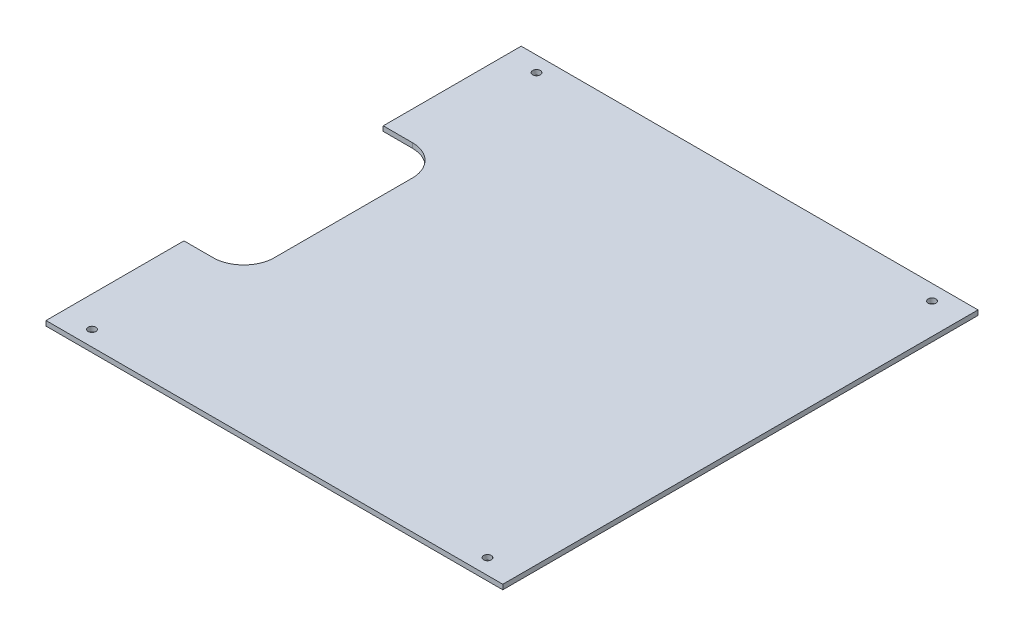
ISO-10303-21;
HEADER;
FILE_DESCRIPTION(('STEP AP214'),'2;1');
FILE_NAME('part.step','',(''),(''),'','','');
FILE_SCHEMA(('AUTOMOTIVE_DESIGN { 1 0 10303 214 1 1 1 1 }'));
ENDSEC;
DATA;
#1=APPLICATION_CONTEXT('core data for automotive mechanical design processes');
#2=APPLICATION_PROTOCOL_DEFINITION('international standard','automotive_design',2000,#1);
#3=PRODUCT_CONTEXT('',#1,'mechanical');
#4=PRODUCT('Part','Part','',(#3));
#5=PRODUCT_RELATED_PRODUCT_CATEGORY('part','',(#4));
#6=PRODUCT_DEFINITION_FORMATION('','',#4);
#7=PRODUCT_DEFINITION_CONTEXT('part definition',#1,'design');
#8=PRODUCT_DEFINITION('design','',#6,#7);
#9=PRODUCT_DEFINITION_SHAPE('','',#8);
#10=(LENGTH_UNIT() NAMED_UNIT(*) SI_UNIT(.MILLI.,.METRE.));
#11=(NAMED_UNIT(*) PLANE_ANGLE_UNIT() SI_UNIT($,.RADIAN.));
#12=(NAMED_UNIT(*) SI_UNIT($,.STERADIAN.) SOLID_ANGLE_UNIT());
#13=UNCERTAINTY_MEASURE_WITH_UNIT(LENGTH_MEASURE(1.E-05),#10,'distance_accuracy_value','');
#14=(GEOMETRIC_REPRESENTATION_CONTEXT(3) GLOBAL_UNCERTAINTY_ASSIGNED_CONTEXT((#13)) GLOBAL_UNIT_ASSIGNED_CONTEXT((#10,
#11,#12)) REPRESENTATION_CONTEXT('',''));
#15=CARTESIAN_POINT('',(0.,0.,0.));
#16=DIRECTION('',(0.,0.,1.));
#17=DIRECTION('',(1.,0.,0.));
#18=AXIS2_PLACEMENT_3D('',#15,#16,#17);
#19=CARTESIAN_POINT('',(0.,3.175,-220.));
#20=DIRECTION('',(0.,0.,-1.));
#21=DIRECTION('',(-1.,0.,0.));
#22=AXIS2_PLACEMENT_3D('',#19,#20,#21);
#23=PLANE('',#22);
#24=DIRECTION('',(1.,0.,0.));
#25=VECTOR('',#24,1.);
#26=CARTESIAN_POINT('',(0.,0.,-220.));
#27=LINE('',#26,#25);
#28=CARTESIAN_POINT('',(21.,0.,-220.));
#29=VERTEX_POINT('',#28);
#30=CARTESIAN_POINT('',(40.,0.,-220.));
#31=VERTEX_POINT('',#30);
#32=EDGE_CURVE('E147',#29,#31,#27,.T.);
#33=ORIENTED_EDGE('',*,*,#32,.T.);
#34=DIRECTION('',(0.,-1.,0.));
#35=VECTOR('',#34,1.);
#36=CARTESIAN_POINT('',(40.,3.175,-220.));
#37=LINE('',#36,#35);
#38=CARTESIAN_POINT('',(40.,3.175,-220.));
#39=VERTEX_POINT('',#38);
#40=EDGE_CURVE('E11',#39,#31,#37,.T.);
#41=ORIENTED_EDGE('',*,*,#40,.F.);
#42=DIRECTION('',(1.,0.,0.));
#43=VECTOR('',#42,1.);
#44=CARTESIAN_POINT('',(0.,3.175,-220.));
#45=LINE('',#44,#43);
#46=CARTESIAN_POINT('',(21.,3.175,-220.));
#47=VERTEX_POINT('',#46);
#48=EDGE_CURVE('E168',#47,#39,#45,.T.);
#49=ORIENTED_EDGE('',*,*,#48,.F.);
#50=DIRECTION('',(0.,-1.,0.));
#51=VECTOR('',#50,1.);
#52=CARTESIAN_POINT('',(21.,3.175,-220.));
#53=LINE('',#52,#51);
#54=EDGE_CURVE('E55',#47,#29,#53,.T.);
#55=ORIENTED_EDGE('',*,*,#54,.T.);
#56=EDGE_LOOP('',(#33,#41,#49,#55));
#57=FACE_BOUND('',#56,.T.);
#58=ADVANCED_FACE('F37',(#57),#23,.F.);
#59=CARTESIAN_POINT('',(40.,3.175,-200.));
#60=DIRECTION('',(0.,-1.,0.));
#61=DIRECTION('',(0.,0.,-1.));
#62=AXIS2_PLACEMENT_3D('',#59,#60,#61);
#63=CYLINDRICAL_SURFACE('',#62,20.);
#64=CARTESIAN_POINT('',(40.,0.,-200.));
#65=DIRECTION('',(0.,1.,0.));
#66=DIRECTION('',(0.,0.,1.));
#67=AXIS2_PLACEMENT_3D('',#64,#65,#66);
#68=CIRCLE('',#67,20.);
#69=CARTESIAN_POINT('',(60.,0.,-200.));
#70=VERTEX_POINT('',#69);
#71=EDGE_CURVE('E149',#31,#70,#68,.F.);
#72=ORIENTED_EDGE('',*,*,#71,.T.);
#73=DIRECTION('',(0.,-1.,0.));
#74=VECTOR('',#73,1.);
#75=CARTESIAN_POINT('',(60.,3.175,-200.));
#76=LINE('',#75,#74);
#77=CARTESIAN_POINT('',(60.,3.175,-200.));
#78=VERTEX_POINT('',#77);
#79=EDGE_CURVE('E46',#78,#70,#76,.T.);
#80=ORIENTED_EDGE('',*,*,#79,.F.);
#81=CARTESIAN_POINT('',(40.,3.175,-200.));
#82=DIRECTION('',(0.,1.,0.));
#83=DIRECTION('',(0.,0.,1.));
#84=AXIS2_PLACEMENT_3D('',#81,#82,#83);
#85=CIRCLE('',#84,20.);
#86=EDGE_CURVE('E99',#39,#78,#85,.F.);
#87=ORIENTED_EDGE('',*,*,#86,.F.);
#88=ORIENTED_EDGE('',*,*,#40,.T.);
#89=EDGE_LOOP('',(#72,#80,#87,#88));
#90=FACE_BOUND('',#89,.T.);
#91=ADVANCED_FACE('F216',(#90),#63,.F.);
#92=CARTESIAN_POINT('',(60.0000000000001,3.175,0.));
#93=DIRECTION('',(1.,0.,0.));
#94=DIRECTION('',(0.,0.,-1.));
#95=AXIS2_PLACEMENT_3D('',#92,#93,#94);
#96=PLANE('',#95);
#97=DIRECTION('',(0.,0.,1.));
#98=VECTOR('',#97,1.);
#99=CARTESIAN_POINT('',(60.0000000000001,0.,0.));
#100=LINE('',#99,#98);
#101=CARTESIAN_POINT('',(60.,0.,-110.));
#102=VERTEX_POINT('',#101);
#103=EDGE_CURVE('E151',#70,#102,#100,.T.);
#104=ORIENTED_EDGE('',*,*,#103,.T.);
#105=DIRECTION('',(0.,-1.,0.));
#106=VECTOR('',#105,1.);
#107=CARTESIAN_POINT('',(60.,3.175,-110.));
#108=LINE('',#107,#106);
#109=CARTESIAN_POINT('',(60.,3.175,-110.));
#110=VERTEX_POINT('',#109);
#111=EDGE_CURVE('E181',#110,#102,#108,.T.);
#112=ORIENTED_EDGE('',*,*,#111,.F.);
#113=DIRECTION('',(0.,0.,1.));
#114=VECTOR('',#113,1.);
#115=CARTESIAN_POINT('',(60.0000000000001,3.175,0.));
#116=LINE('',#115,#114);
#117=EDGE_CURVE('E277',#78,#110,#116,.T.);
#118=ORIENTED_EDGE('',*,*,#117,.F.);
#119=ORIENTED_EDGE('',*,*,#79,.T.);
#120=EDGE_LOOP('',(#104,#112,#118,#119));
#121=FACE_BOUND('',#120,.T.);
#122=ADVANCED_FACE('F220',(#121),#96,.F.);
#123=CARTESIAN_POINT('',(40.,3.175,-110.));
#124=DIRECTION('',(0.,-1.,0.));
#125=DIRECTION('',(0.,0.,-1.));
#126=AXIS2_PLACEMENT_3D('',#123,#124,#125);
#127=CYLINDRICAL_SURFACE('',#126,20.);
#128=CARTESIAN_POINT('',(40.,0.,-110.));
#129=DIRECTION('',(0.,1.,0.));
#130=DIRECTION('',(0.,0.,1.));
#131=AXIS2_PLACEMENT_3D('',#128,#129,#130);
#132=CIRCLE('',#131,20.);
#133=CARTESIAN_POINT('',(40.,0.,-90.));
#134=VERTEX_POINT('',#133);
#135=EDGE_CURVE('E153',#102,#134,#132,.F.);
#136=ORIENTED_EDGE('',*,*,#135,.T.);
#137=DIRECTION('',(0.,-1.,0.));
#138=VECTOR('',#137,1.);
#139=CARTESIAN_POINT('',(40.,3.175,-90.));
#140=LINE('',#139,#138);
#141=CARTESIAN_POINT('',(40.,3.175,-90.));
#142=VERTEX_POINT('',#141);
#143=EDGE_CURVE('E178',#142,#134,#140,.T.);
#144=ORIENTED_EDGE('',*,*,#143,.F.);
#145=CARTESIAN_POINT('',(40.,3.175,-110.));
#146=DIRECTION('',(0.,1.,0.));
#147=DIRECTION('',(0.,0.,1.));
#148=AXIS2_PLACEMENT_3D('',#145,#146,#147);
#149=CIRCLE('',#148,20.);
#150=EDGE_CURVE('E263',#110,#142,#149,.F.);
#151=ORIENTED_EDGE('',*,*,#150,.F.);
#152=ORIENTED_EDGE('',*,*,#111,.T.);
#153=EDGE_LOOP('',(#136,#144,#151,#152));
#154=FACE_BOUND('',#153,.T.);
#155=ADVANCED_FACE('F249',(#154),#127,.F.);
#156=CARTESIAN_POINT('',(0.,3.175,-90.));
#157=DIRECTION('',(0.,0.,1.));
#158=DIRECTION('',(1.,0.,0.));
#159=AXIS2_PLACEMENT_3D('',#156,#157,#158);
#160=PLANE('',#159);
#161=DIRECTION('',(-1.,0.,0.));
#162=VECTOR('',#161,1.);
#163=CARTESIAN_POINT('',(0.,0.,-90.));
#164=LINE('',#163,#162);
#165=CARTESIAN_POINT('',(21.,0.,-90.));
#166=VERTEX_POINT('',#165);
#167=EDGE_CURVE('E155',#134,#166,#164,.T.);
#168=ORIENTED_EDGE('',*,*,#167,.T.);
#169=DIRECTION('',(0.,-1.,0.));
#170=VECTOR('',#169,1.);
#171=CARTESIAN_POINT('',(21.,3.175,-90.));
#172=LINE('',#171,#170);
#173=CARTESIAN_POINT('',(21.,3.175,-90.));
#174=VERTEX_POINT('',#173);
#175=EDGE_CURVE('E175',#174,#166,#172,.T.);
#176=ORIENTED_EDGE('',*,*,#175,.F.);
#177=DIRECTION('',(-1.,0.,0.));
#178=VECTOR('',#177,1.);
#179=CARTESIAN_POINT('',(0.,3.175,-90.));
#180=LINE('',#179,#178);
#181=EDGE_CURVE('E272',#142,#174,#180,.T.);
#182=ORIENTED_EDGE('',*,*,#181,.F.);
#183=ORIENTED_EDGE('',*,*,#143,.T.);
#184=EDGE_LOOP('',(#168,#176,#182,#183));
#185=FACE_BOUND('',#184,.T.);
#186=ADVANCED_FACE('F245',(#185),#160,.F.);
#187=CARTESIAN_POINT('',(21.,3.175,0.));
#188=DIRECTION('',(1.,0.,0.));
#189=DIRECTION('',(0.,0.,-1.));
#190=AXIS2_PLACEMENT_3D('',#187,#188,#189);
#191=PLANE('',#190);
#192=DIRECTION('',(0.,0.,1.));
#193=VECTOR('',#192,1.);
#194=CARTESIAN_POINT('',(21.,0.,0.));
#195=LINE('',#194,#193);
#196=CARTESIAN_POINT('',(21.,0.,0.));
#197=VERTEX_POINT('',#196);
#198=EDGE_CURVE('E157',#166,#197,#195,.T.);
#199=ORIENTED_EDGE('',*,*,#198,.T.);
#200=DIRECTION('',(0.,-1.,0.));
#201=VECTOR('',#200,1.);
#202=CARTESIAN_POINT('',(21.,3.175,0.));
#203=LINE('',#202,#201);
#204=CARTESIAN_POINT('',(21.,3.175,0.));
#205=VERTEX_POINT('',#204);
#206=EDGE_CURVE('E172',#205,#197,#203,.T.);
#207=ORIENTED_EDGE('',*,*,#206,.F.);
#208=DIRECTION('',(0.,0.,1.));
#209=VECTOR('',#208,1.);
#210=CARTESIAN_POINT('',(21.,3.175,0.));
#211=LINE('',#210,#209);
#212=EDGE_CURVE('E271',#174,#205,#211,.T.);
#213=ORIENTED_EDGE('',*,*,#212,.F.);
#214=ORIENTED_EDGE('',*,*,#175,.T.);
#215=EDGE_LOOP('',(#199,#207,#213,#214));
#216=FACE_BOUND('',#215,.T.);
#217=ADVANCED_FACE('F241',(#216),#191,.F.);
#218=CARTESIAN_POINT('',(0.,3.175,0.));
#219=DIRECTION('',(0.,0.,-1.));
#220=DIRECTION('',(-1.,0.,0.));
#221=AXIS2_PLACEMENT_3D('',#218,#219,#220);
#222=PLANE('',#221);
#223=DIRECTION('',(1.,0.,0.));
#224=VECTOR('',#223,1.);
#225=CARTESIAN_POINT('',(0.,0.,0.));
#226=LINE('',#225,#224);
#227=CARTESIAN_POINT('',(319.,0.,0.));
#228=VERTEX_POINT('',#227);
#229=EDGE_CURVE('E159',#197,#228,#226,.T.);
#230=ORIENTED_EDGE('',*,*,#229,.T.);
#231=DIRECTION('',(0.,-1.,0.));
#232=VECTOR('',#231,1.);
#233=CARTESIAN_POINT('',(319.,3.175,0.));
#234=LINE('',#233,#232);
#235=CARTESIAN_POINT('',(319.,3.175,0.));
#236=VERTEX_POINT('',#235);
#237=EDGE_CURVE('E130',#236,#228,#234,.T.);
#238=ORIENTED_EDGE('',*,*,#237,.F.);
#239=DIRECTION('',(1.,0.,0.));
#240=VECTOR('',#239,1.);
#241=CARTESIAN_POINT('',(0.,3.175,0.));
#242=LINE('',#241,#240);
#243=EDGE_CURVE('E138',#205,#236,#242,.T.);
#244=ORIENTED_EDGE('',*,*,#243,.F.);
#245=ORIENTED_EDGE('',*,*,#206,.T.);
#246=EDGE_LOOP('',(#230,#238,#244,#245));
#247=FACE_BOUND('',#246,.T.);
#248=ADVANCED_FACE('F238',(#247),#222,.F.);
#249=CARTESIAN_POINT('',(319.,3.175,0.));
#250=DIRECTION('',(1.,0.,0.));
#251=DIRECTION('',(0.,0.,-1.));
#252=AXIS2_PLACEMENT_3D('',#249,#250,#251);
#253=PLANE('',#252);
#254=DIRECTION('',(0.,0.,1.));
#255=VECTOR('',#254,1.);
#256=CARTESIAN_POINT('',(319.,0.,0.));
#257=LINE('',#256,#255);
#258=CARTESIAN_POINT('',(319.,0.,-310.));
#259=VERTEX_POINT('',#258);
#260=EDGE_CURVE('E126',#259,#228,#257,.T.);
#261=ORIENTED_EDGE('',*,*,#260,.F.);
#262=DIRECTION('',(0.,-1.,0.));
#263=VECTOR('',#262,1.);
#264=CARTESIAN_POINT('',(319.,3.175,-310.));
#265=LINE('',#264,#263);
#266=CARTESIAN_POINT('',(319.,3.175,-310.));
#267=VERTEX_POINT('',#266);
#268=EDGE_CURVE('E121',#267,#259,#265,.T.);
#269=ORIENTED_EDGE('',*,*,#268,.F.);
#270=DIRECTION('',(0.,0.,1.));
#271=VECTOR('',#270,1.);
#272=CARTESIAN_POINT('',(319.,3.175,0.));
#273=LINE('',#272,#271);
#274=EDGE_CURVE('E124',#267,#236,#273,.T.);
#275=ORIENTED_EDGE('',*,*,#274,.T.);
#276=ORIENTED_EDGE('',*,*,#237,.T.);
#277=EDGE_LOOP('',(#261,#269,#275,#276));
#278=FACE_BOUND('',#277,.T.);
#279=ADVANCED_FACE('F123',(#278),#253,.T.);
#280=CARTESIAN_POINT('',(0.,3.175,-310.));
#281=DIRECTION('',(0.,0.,-1.));
#282=DIRECTION('',(-1.,0.,0.));
#283=AXIS2_PLACEMENT_3D('',#280,#281,#282);
#284=PLANE('',#283);
#285=DIRECTION('',(1.,0.,0.));
#286=VECTOR('',#285,1.);
#287=CARTESIAN_POINT('',(0.,0.,-310.));
#288=LINE('',#287,#286);
#289=CARTESIAN_POINT('',(20.9999999999999,0.,-310.));
#290=VERTEX_POINT('',#289);
#291=EDGE_CURVE('E163',#290,#259,#288,.T.);
#292=ORIENTED_EDGE('',*,*,#291,.F.);
#293=DIRECTION('',(0.,-1.,0.));
#294=VECTOR('',#293,1.);
#295=CARTESIAN_POINT('',(20.9999999999999,3.175,-310.));
#296=LINE('',#295,#294);
#297=CARTESIAN_POINT('',(20.9999999999999,3.175,-310.));
#298=VERTEX_POINT('',#297);
#299=EDGE_CURVE('E87',#298,#290,#296,.T.);
#300=ORIENTED_EDGE('',*,*,#299,.F.);
#301=DIRECTION('',(1.,0.,0.));
#302=VECTOR('',#301,1.);
#303=CARTESIAN_POINT('',(0.,3.175,-310.));
#304=LINE('',#303,#302);
#305=EDGE_CURVE('E136',#298,#267,#304,.T.);
#306=ORIENTED_EDGE('',*,*,#305,.T.);
#307=ORIENTED_EDGE('',*,*,#268,.T.);
#308=EDGE_LOOP('',(#292,#300,#306,#307));
#309=FACE_BOUND('',#308,.T.);
#310=ADVANCED_FACE('F141',(#309),#284,.T.);
#311=CARTESIAN_POINT('',(21.,3.175,0.));
#312=DIRECTION('',(-1.,0.,0.));
#313=DIRECTION('',(0.,0.,1.));
#314=AXIS2_PLACEMENT_3D('',#311,#312,#313);
#315=PLANE('',#314);
#316=DIRECTION('',(0.,0.,-1.));
#317=VECTOR('',#316,1.);
#318=CARTESIAN_POINT('',(21.,0.,0.));
#319=LINE('',#318,#317);
#320=EDGE_CURVE('E165',#29,#290,#319,.T.);
#321=ORIENTED_EDGE('',*,*,#320,.F.);
#322=ORIENTED_EDGE('',*,*,#54,.F.);
#323=DIRECTION('',(0.,0.,-1.));
#324=VECTOR('',#323,1.);
#325=CARTESIAN_POINT('',(21.,3.175,0.));
#326=LINE('',#325,#324);
#327=EDGE_CURVE('E142',#47,#298,#326,.T.);
#328=ORIENTED_EDGE('',*,*,#327,.T.);
#329=ORIENTED_EDGE('',*,*,#299,.T.);
#330=EDGE_LOOP('',(#321,#322,#328,#329));
#331=FACE_BOUND('',#330,.T.);
#332=ADVANCED_FACE('F224',(#331),#315,.T.);
#333=CARTESIAN_POINT('',(0.,3.175,0.));
#334=DIRECTION('',(0.,1.,0.));
#335=DIRECTION('',(0.,0.,1.));
#336=AXIS2_PLACEMENT_3D('',#333,#334,#335);
#337=PLANE('',#336);
#338=CARTESIAN_POINT('',(299.,3.175,-300.));
#339=DIRECTION('',(0.,1.,0.));
#340=DIRECTION('',(0.,0.,1.));
#341=AXIS2_PLACEMENT_3D('',#338,#339,#340);
#342=CIRCLE('',#341,2.50000000000002);
#343=CARTESIAN_POINT('',(299.,3.175,-297.5));
#344=VERTEX_POINT('',#343);
#345=EDGE_CURVE('E283',#344,#344,#342,.T.);
#346=ORIENTED_EDGE('',*,*,#345,.F.);
#347=EDGE_LOOP('',(#346));
#348=FACE_BOUND('',#347,.T.);
#349=CARTESIAN_POINT('',(299.,3.175,-10.));
#350=DIRECTION('',(0.,1.,0.));
#351=DIRECTION('',(0.,0.,1.));
#352=AXIS2_PLACEMENT_3D('',#349,#350,#351);
#353=CIRCLE('',#352,2.50000000000002);
#354=CARTESIAN_POINT('',(299.,3.175,-7.49999999999998));
#355=VERTEX_POINT('',#354);
#356=EDGE_CURVE('E285',#355,#355,#353,.T.);
#357=ORIENTED_EDGE('',*,*,#356,.F.);
#358=EDGE_LOOP('',(#357));
#359=FACE_BOUND('',#358,.T.);
#360=CARTESIAN_POINT('',(41.,3.175,-10.));
#361=DIRECTION('',(0.,1.,0.));
#362=DIRECTION('',(0.,0.,1.));
#363=AXIS2_PLACEMENT_3D('',#360,#361,#362);
#364=CIRCLE('',#363,2.5);
#365=CARTESIAN_POINT('',(41.,3.175,-7.49999999999999));
#366=VERTEX_POINT('',#365);
#367=EDGE_CURVE('E286',#366,#366,#364,.T.);
#368=ORIENTED_EDGE('',*,*,#367,.F.);
#369=EDGE_LOOP('',(#368));
#370=FACE_BOUND('',#369,.T.);
#371=CARTESIAN_POINT('',(40.9999999999999,3.175,-300.));
#372=DIRECTION('',(0.,1.,0.));
#373=DIRECTION('',(0.,0.,1.));
#374=AXIS2_PLACEMENT_3D('',#371,#372,#373);
#375=CIRCLE('',#374,2.5);
#376=CARTESIAN_POINT('',(40.9999999999999,3.175,-297.5));
#377=VERTEX_POINT('',#376);
#378=EDGE_CURVE('E190',#377,#377,#375,.T.);
#379=ORIENTED_EDGE('',*,*,#378,.F.);
#380=EDGE_LOOP('',(#379));
#381=FACE_BOUND('',#380,.T.);
#382=ORIENTED_EDGE('',*,*,#48,.T.);
#383=ORIENTED_EDGE('',*,*,#86,.T.);
#384=ORIENTED_EDGE('',*,*,#117,.T.);
#385=ORIENTED_EDGE('',*,*,#150,.T.);
#386=ORIENTED_EDGE('',*,*,#181,.T.);
#387=ORIENTED_EDGE('',*,*,#212,.T.);
#388=ORIENTED_EDGE('',*,*,#243,.T.);
#389=ORIENTED_EDGE('',*,*,#274,.F.);
#390=ORIENTED_EDGE('',*,*,#305,.F.);
#391=ORIENTED_EDGE('',*,*,#327,.F.);
#392=EDGE_LOOP('',(#382,#383,#384,#385,#386,#387,#388,#389,#390,#391));
#393=FACE_BOUND('',#392,.T.);
#394=ADVANCED_FACE('F134',(#348,#359,#370,#381,#393),#337,.T.);
#395=CARTESIAN_POINT('',(0.,0.,0.));
#396=DIRECTION('',(0.,1.,0.));
#397=DIRECTION('',(0.,0.,1.));
#398=AXIS2_PLACEMENT_3D('',#395,#396,#397);
#399=PLANE('',#398);
#400=CARTESIAN_POINT('',(299.,0.,-300.));
#401=DIRECTION('',(0.,1.,0.));
#402=DIRECTION('',(0.,0.,1.));
#403=AXIS2_PLACEMENT_3D('',#400,#401,#402);
#404=CIRCLE('',#403,2.50000000000002);
#405=CARTESIAN_POINT('',(299.,0.,-297.5));
#406=VERTEX_POINT('',#405);
#407=EDGE_CURVE('E40',#406,#406,#404,.T.);
#408=ORIENTED_EDGE('',*,*,#407,.T.);
#409=EDGE_LOOP('',(#408));
#410=FACE_BOUND('',#409,.T.);
#411=CARTESIAN_POINT('',(299.,0.,-10.));
#412=DIRECTION('',(0.,1.,0.));
#413=DIRECTION('',(0.,0.,1.));
#414=AXIS2_PLACEMENT_3D('',#411,#412,#413);
#415=CIRCLE('',#414,2.50000000000002);
#416=CARTESIAN_POINT('',(299.,0.,-7.49999999999998));
#417=VERTEX_POINT('',#416);
#418=EDGE_CURVE('E192',#417,#417,#415,.T.);
#419=ORIENTED_EDGE('',*,*,#418,.T.);
#420=EDGE_LOOP('',(#419));
#421=FACE_BOUND('',#420,.T.);
#422=CARTESIAN_POINT('',(41.,0.,-10.));
#423=DIRECTION('',(0.,1.,0.));
#424=DIRECTION('',(0.,0.,1.));
#425=AXIS2_PLACEMENT_3D('',#422,#423,#424);
#426=CIRCLE('',#425,2.5);
#427=CARTESIAN_POINT('',(41.,0.,-7.49999999999999));
#428=VERTEX_POINT('',#427);
#429=EDGE_CURVE('E189',#428,#428,#426,.T.);
#430=ORIENTED_EDGE('',*,*,#429,.T.);
#431=EDGE_LOOP('',(#430));
#432=FACE_BOUND('',#431,.T.);
#433=CARTESIAN_POINT('',(40.9999999999999,0.,-300.));
#434=DIRECTION('',(0.,1.,0.));
#435=DIRECTION('',(0.,0.,1.));
#436=AXIS2_PLACEMENT_3D('',#433,#434,#435);
#437=CIRCLE('',#436,2.5);
#438=CARTESIAN_POINT('',(40.9999999999999,0.,-297.5));
#439=VERTEX_POINT('',#438);
#440=EDGE_CURVE('E186',#439,#439,#437,.T.);
#441=ORIENTED_EDGE('',*,*,#440,.T.);
#442=EDGE_LOOP('',(#441));
#443=FACE_BOUND('',#442,.T.);
#444=ORIENTED_EDGE('',*,*,#32,.F.);
#445=ORIENTED_EDGE('',*,*,#320,.T.);
#446=ORIENTED_EDGE('',*,*,#291,.T.);
#447=ORIENTED_EDGE('',*,*,#260,.T.);
#448=ORIENTED_EDGE('',*,*,#229,.F.);
#449=ORIENTED_EDGE('',*,*,#198,.F.);
#450=ORIENTED_EDGE('',*,*,#167,.F.);
#451=ORIENTED_EDGE('',*,*,#135,.F.);
#452=ORIENTED_EDGE('',*,*,#103,.F.);
#453=ORIENTED_EDGE('',*,*,#71,.F.);
#454=EDGE_LOOP('',(#444,#445,#446,#447,#448,#449,#450,#451,#452,#453));
#455=FACE_BOUND('',#454,.T.);
#456=ADVANCED_FACE('F199',(#410,#421,#432,#443,#455),#399,.F.);
#457=CARTESIAN_POINT('',(40.9999999999999,-6.825,-300.));
#458=DIRECTION('',(0.,1.,0.));
#459=DIRECTION('',(0.,0.,1.));
#460=AXIS2_PLACEMENT_3D('',#457,#458,#459);
#461=CYLINDRICAL_SURFACE('',#460,2.5);
#462=ORIENTED_EDGE('',*,*,#378,.T.);
#463=EDGE_LOOP('',(#462));
#464=FACE_BOUND('',#463,.T.);
#465=ORIENTED_EDGE('',*,*,#440,.F.);
#466=EDGE_LOOP('',(#465));
#467=FACE_BOUND('',#466,.T.);
#468=ADVANCED_FACE('F298',(#464,#467),#461,.F.);
#469=CARTESIAN_POINT('',(41.,-6.825,-10.));
#470=DIRECTION('',(0.,1.,0.));
#471=DIRECTION('',(0.,0.,1.));
#472=AXIS2_PLACEMENT_3D('',#469,#470,#471);
#473=CYLINDRICAL_SURFACE('',#472,2.5);
#474=ORIENTED_EDGE('',*,*,#367,.T.);
#475=EDGE_LOOP('',(#474));
#476=FACE_BOUND('',#475,.T.);
#477=ORIENTED_EDGE('',*,*,#429,.F.);
#478=EDGE_LOOP('',(#477));
#479=FACE_BOUND('',#478,.T.);
#480=ADVANCED_FACE('F209',(#476,#479),#473,.F.);
#481=CARTESIAN_POINT('',(299.,-6.825,-10.));
#482=DIRECTION('',(0.,1.,0.));
#483=DIRECTION('',(0.,0.,1.));
#484=AXIS2_PLACEMENT_3D('',#481,#482,#483);
#485=CYLINDRICAL_SURFACE('',#484,2.50000000000002);
#486=ORIENTED_EDGE('',*,*,#356,.T.);
#487=EDGE_LOOP('',(#486));
#488=FACE_BOUND('',#487,.T.);
#489=ORIENTED_EDGE('',*,*,#418,.F.);
#490=EDGE_LOOP('',(#489));
#491=FACE_BOUND('',#490,.T.);
#492=ADVANCED_FACE('F203',(#488,#491),#485,.F.);
#493=CARTESIAN_POINT('',(299.,-6.825,-300.));
#494=DIRECTION('',(0.,1.,0.));
#495=DIRECTION('',(0.,0.,1.));
#496=AXIS2_PLACEMENT_3D('',#493,#494,#495);
#497=CYLINDRICAL_SURFACE('',#496,2.50000000000002);
#498=ORIENTED_EDGE('',*,*,#345,.T.);
#499=EDGE_LOOP('',(#498));
#500=FACE_BOUND('',#499,.T.);
#501=ORIENTED_EDGE('',*,*,#407,.F.);
#502=EDGE_LOOP('',(#501));
#503=FACE_BOUND('',#502,.T.);
#504=ADVANCED_FACE('F201',(#500,#503),#497,.F.);
#505=CLOSED_SHELL('',(#58,#91,#122,#155,#186,#217,#248,#279,#310,#332,#394,#456,#468,#480,#492,#504));
#506=MANIFOLD_SOLID_BREP('B2',#505);
#507=ADVANCED_BREP_SHAPE_REPRESENTATION('',(#18,#506),#14);
#508=SHAPE_DEFINITION_REPRESENTATION(#9,#507);
ENDSEC;
END-ISO-10303-21;
